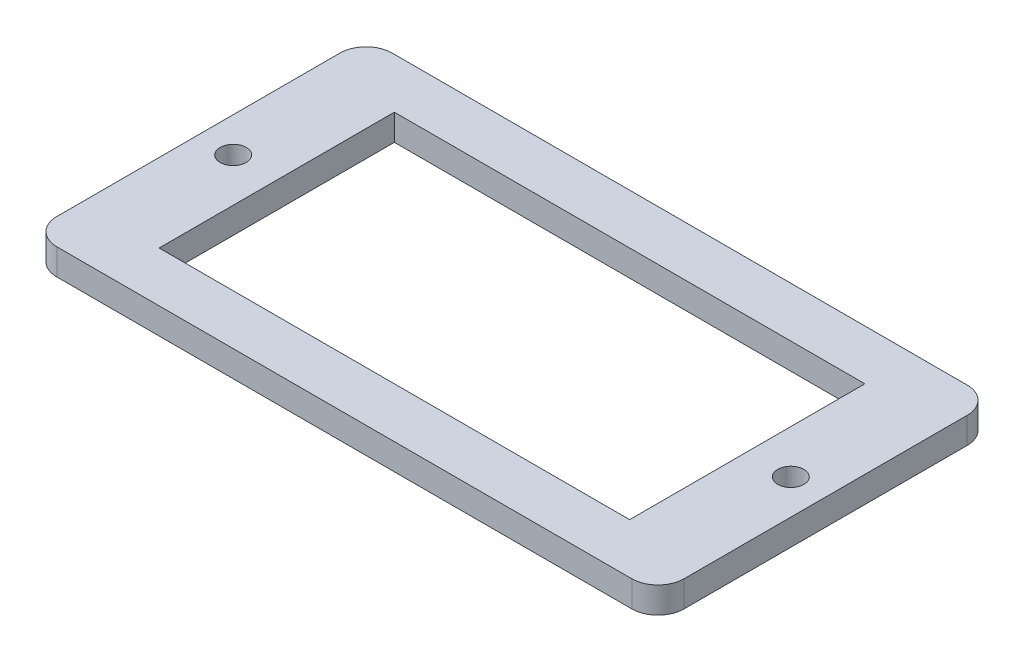
ISO-10303-21;
HEADER;
FILE_DESCRIPTION(('STEP AP214'),'2;1');
FILE_NAME('part.step','',(''),(''),'','','');
FILE_SCHEMA(('AUTOMOTIVE_DESIGN { 1 0 10303 214 1 1 1 1 }'));
ENDSEC;
DATA;
#1=APPLICATION_CONTEXT('core data for automotive mechanical design processes');
#2=APPLICATION_PROTOCOL_DEFINITION('international standard','automotive_design',2000,#1);
#3=PRODUCT_CONTEXT('',#1,'mechanical');
#4=PRODUCT('Part','Part','',(#3));
#5=PRODUCT_RELATED_PRODUCT_CATEGORY('part','',(#4));
#6=PRODUCT_DEFINITION_FORMATION('','',#4);
#7=PRODUCT_DEFINITION_CONTEXT('part definition',#1,'design');
#8=PRODUCT_DEFINITION('design','',#6,#7);
#9=PRODUCT_DEFINITION_SHAPE('','',#8);
#10=(LENGTH_UNIT() NAMED_UNIT(*) SI_UNIT(.MILLI.,.METRE.));
#11=(NAMED_UNIT(*) PLANE_ANGLE_UNIT() SI_UNIT($,.RADIAN.));
#12=(NAMED_UNIT(*) SI_UNIT($,.STERADIAN.) SOLID_ANGLE_UNIT());
#13=UNCERTAINTY_MEASURE_WITH_UNIT(LENGTH_MEASURE(1.E-05),#10,'distance_accuracy_value','');
#14=(GEOMETRIC_REPRESENTATION_CONTEXT(3) GLOBAL_UNCERTAINTY_ASSIGNED_CONTEXT((#13)) GLOBAL_UNIT_ASSIGNED_CONTEXT((#10,
#11,#12)) REPRESENTATION_CONTEXT('',''));
#15=CARTESIAN_POINT('',(0.,0.,0.));
#16=DIRECTION('',(0.,0.,1.));
#17=DIRECTION('',(1.,0.,0.));
#18=AXIS2_PLACEMENT_3D('',#15,#16,#17);
#19=CARTESIAN_POINT('',(0.,3.,0.));
#20=DIRECTION('',(0.,1.,0.));
#21=DIRECTION('',(0.,0.,1.));
#22=AXIS2_PLACEMENT_3D('',#19,#20,#21);
#23=PLANE('',#22);
#24=CARTESIAN_POINT('',(-32.,3.,0.));
#25=DIRECTION('',(0.,1.,0.));
#26=DIRECTION('',(0.,0.,1.));
#27=AXIS2_PLACEMENT_3D('',#24,#25,#26);
#28=CIRCLE('',#27,1.5);
#29=CARTESIAN_POINT('',(-32.,3.,1.5));
#30=VERTEX_POINT('',#29);
#31=EDGE_CURVE('E157',#30,#30,#28,.T.);
#32=ORIENTED_EDGE('',*,*,#31,.F.);
#33=EDGE_LOOP('',(#32));
#34=FACE_BOUND('',#33,.T.);
#35=DIRECTION('',(-1.,0.,0.));
#36=VECTOR('',#35,1.);
#37=CARTESIAN_POINT('',(-36.,3.,-19.25));
#38=LINE('',#37,#36);
#39=CARTESIAN_POINT('',(33.,3.,-19.25));
#40=VERTEX_POINT('',#39);
#41=CARTESIAN_POINT('',(-33.,3.,-19.25));
#42=VERTEX_POINT('',#41);
#43=EDGE_CURVE('E176',#40,#42,#38,.T.);
#44=ORIENTED_EDGE('',*,*,#43,.T.);
#45=CARTESIAN_POINT('',(-33.,3.,-16.25));
#46=DIRECTION('',(0.,1.,0.));
#47=DIRECTION('',(0.,0.,1.));
#48=AXIS2_PLACEMENT_3D('',#45,#46,#47);
#49=CIRCLE('',#48,3.);
#50=CARTESIAN_POINT('',(-36.,3.,-16.25));
#51=VERTEX_POINT('',#50);
#52=EDGE_CURVE('E211',#42,#51,#49,.T.);
#53=ORIENTED_EDGE('',*,*,#52,.T.);
#54=DIRECTION('',(0.,0.,1.));
#55=VECTOR('',#54,1.);
#56=CARTESIAN_POINT('',(-36.,3.,-19.25));
#57=LINE('',#56,#55);
#58=CARTESIAN_POINT('',(-36.,3.,16.25));
#59=VERTEX_POINT('',#58);
#60=EDGE_CURVE('E168',#51,#59,#57,.T.);
#61=ORIENTED_EDGE('',*,*,#60,.T.);
#62=CARTESIAN_POINT('',(-33.,3.,16.25));
#63=DIRECTION('',(0.,1.,0.));
#64=DIRECTION('',(0.,0.,1.));
#65=AXIS2_PLACEMENT_3D('',#62,#63,#64);
#66=CIRCLE('',#65,3.);
#67=CARTESIAN_POINT('',(-33.,3.,19.25));
#68=VERTEX_POINT('',#67);
#69=EDGE_CURVE('E206',#59,#68,#66,.T.);
#70=ORIENTED_EDGE('',*,*,#69,.T.);
#71=DIRECTION('',(1.,0.,0.));
#72=VECTOR('',#71,1.);
#73=CARTESIAN_POINT('',(-36.,3.,19.25));
#74=LINE('',#73,#72);
#75=CARTESIAN_POINT('',(33.,3.,19.25));
#76=VERTEX_POINT('',#75);
#77=EDGE_CURVE('E171',#68,#76,#74,.T.);
#78=ORIENTED_EDGE('',*,*,#77,.T.);
#79=CARTESIAN_POINT('',(33.,3.,16.25));
#80=DIRECTION('',(0.,1.,0.));
#81=DIRECTION('',(0.,0.,1.));
#82=AXIS2_PLACEMENT_3D('',#79,#80,#81);
#83=CIRCLE('',#82,3.);
#84=CARTESIAN_POINT('',(36.,3.,16.25));
#85=VERTEX_POINT('',#84);
#86=EDGE_CURVE('E55',#76,#85,#83,.T.);
#87=ORIENTED_EDGE('',*,*,#86,.T.);
#88=DIRECTION('',(0.,0.,-1.));
#89=VECTOR('',#88,1.);
#90=CARTESIAN_POINT('',(36.,3.,-19.25));
#91=LINE('',#90,#89);
#92=CARTESIAN_POINT('',(36.,3.,-16.25));
#93=VERTEX_POINT('',#92);
#94=EDGE_CURVE('E174',#85,#93,#91,.T.);
#95=ORIENTED_EDGE('',*,*,#94,.T.);
#96=CARTESIAN_POINT('',(33.,3.,-16.25));
#97=DIRECTION('',(0.,1.,0.));
#98=DIRECTION('',(0.,0.,1.));
#99=AXIS2_PLACEMENT_3D('',#96,#97,#98);
#100=CIRCLE('',#99,3.);
#101=EDGE_CURVE('E209',#93,#40,#100,.T.);
#102=ORIENTED_EDGE('',*,*,#101,.T.);
#103=EDGE_LOOP('',(#44,#53,#61,#70,#78,#87,#95,#102));
#104=FACE_BOUND('',#103,.T.);
#105=DIRECTION('',(1.,0.,0.));
#106=VECTOR('',#105,1.);
#107=CARTESIAN_POINT('',(-27.,3.,13.5));
#108=LINE('',#107,#106);
#109=CARTESIAN_POINT('',(-27.,3.,13.5));
#110=VERTEX_POINT('',#109);
#111=CARTESIAN_POINT('',(27.,3.,13.5));
#112=VERTEX_POINT('',#111);
#113=EDGE_CURVE('E134',#110,#112,#108,.T.);
#114=ORIENTED_EDGE('',*,*,#113,.F.);
#115=DIRECTION('',(0.,0.,1.));
#116=VECTOR('',#115,1.);
#117=CARTESIAN_POINT('',(-27.,3.,-13.5));
#118=LINE('',#117,#116);
#119=CARTESIAN_POINT('',(-27.,3.,-13.5));
#120=VERTEX_POINT('',#119);
#121=EDGE_CURVE('E124',#120,#110,#118,.T.);
#122=ORIENTED_EDGE('',*,*,#121,.F.);
#123=DIRECTION('',(-1.,0.,0.));
#124=VECTOR('',#123,1.);
#125=CARTESIAN_POINT('',(-27.,3.,-13.5));
#126=LINE('',#125,#124);
#127=CARTESIAN_POINT('',(27.,3.,-13.5));
#128=VERTEX_POINT('',#127);
#129=EDGE_CURVE('E150',#128,#120,#126,.T.);
#130=ORIENTED_EDGE('',*,*,#129,.F.);
#131=DIRECTION('',(0.,0.,-1.));
#132=VECTOR('',#131,1.);
#133=CARTESIAN_POINT('',(27.,3.,-13.5));
#134=LINE('',#133,#132);
#135=EDGE_CURVE('E148',#112,#128,#134,.T.);
#136=ORIENTED_EDGE('',*,*,#135,.F.);
#137=EDGE_LOOP('',(#114,#122,#130,#136));
#138=FACE_BOUND('',#137,.T.);
#139=CARTESIAN_POINT('',(32.,3.,0.));
#140=DIRECTION('',(0.,1.,0.));
#141=DIRECTION('',(0.,0.,1.));
#142=AXIS2_PLACEMENT_3D('',#139,#140,#141);
#143=CIRCLE('',#142,1.5);
#144=CARTESIAN_POINT('',(32.,3.,1.49999999999999));
#145=VERTEX_POINT('',#144);
#146=EDGE_CURVE('E395',#145,#145,#143,.T.);
#147=ORIENTED_EDGE('',*,*,#146,.F.);
#148=EDGE_LOOP('',(#147));
#149=FACE_BOUND('',#148,.T.);
#150=ADVANCED_FACE('F33',(#34,#104,#138,#149),#23,.T.);
#151=CARTESIAN_POINT('',(0.,0.,0.));
#152=DIRECTION('',(0.,1.,0.));
#153=DIRECTION('',(0.,0.,1.));
#154=AXIS2_PLACEMENT_3D('',#151,#152,#153);
#155=PLANE('',#154);
#156=CARTESIAN_POINT('',(-32.,0.,0.));
#157=DIRECTION('',(0.,1.,0.));
#158=DIRECTION('',(0.,0.,1.));
#159=AXIS2_PLACEMENT_3D('',#156,#157,#158);
#160=CIRCLE('',#159,1.5);
#161=CARTESIAN_POINT('',(-32.,0.,1.5));
#162=VERTEX_POINT('',#161);
#163=EDGE_CURVE('E398',#162,#162,#160,.T.);
#164=ORIENTED_EDGE('',*,*,#163,.T.);
#165=EDGE_LOOP('',(#164));
#166=FACE_BOUND('',#165,.T.);
#167=DIRECTION('',(0.,0.,1.));
#168=VECTOR('',#167,1.);
#169=CARTESIAN_POINT('',(-36.,0.,-19.25));
#170=LINE('',#169,#168);
#171=CARTESIAN_POINT('',(-36.,0.,-16.25));
#172=VERTEX_POINT('',#171);
#173=CARTESIAN_POINT('',(-36.,0.,16.25));
#174=VERTEX_POINT('',#173);
#175=EDGE_CURVE('E142',#172,#174,#170,.T.);
#176=ORIENTED_EDGE('',*,*,#175,.F.);
#177=CARTESIAN_POINT('',(-33.,0.,-16.25));
#178=DIRECTION('',(0.,1.,0.));
#179=DIRECTION('',(0.,0.,1.));
#180=AXIS2_PLACEMENT_3D('',#177,#178,#179);
#181=CIRCLE('',#180,3.);
#182=CARTESIAN_POINT('',(-33.,0.,-19.25));
#183=VERTEX_POINT('',#182);
#184=EDGE_CURVE('E199',#172,#183,#181,.F.);
#185=ORIENTED_EDGE('',*,*,#184,.T.);
#186=DIRECTION('',(-1.,0.,0.));
#187=VECTOR('',#186,1.);
#188=CARTESIAN_POINT('',(-36.,0.,-19.25));
#189=LINE('',#188,#187);
#190=CARTESIAN_POINT('',(33.,0.,-19.25));
#191=VERTEX_POINT('',#190);
#192=EDGE_CURVE('E172',#191,#183,#189,.T.);
#193=ORIENTED_EDGE('',*,*,#192,.F.);
#194=CARTESIAN_POINT('',(33.,0.,-16.25));
#195=DIRECTION('',(0.,1.,0.));
#196=DIRECTION('',(0.,0.,1.));
#197=AXIS2_PLACEMENT_3D('',#194,#195,#196);
#198=CIRCLE('',#197,3.);
#199=CARTESIAN_POINT('',(36.,0.,-16.25));
#200=VERTEX_POINT('',#199);
#201=EDGE_CURVE('E197',#191,#200,#198,.F.);
#202=ORIENTED_EDGE('',*,*,#201,.T.);
#203=DIRECTION('',(0.,0.,-1.));
#204=VECTOR('',#203,1.);
#205=CARTESIAN_POINT('',(36.,0.,-19.25));
#206=LINE('',#205,#204);
#207=CARTESIAN_POINT('',(36.,0.,16.25));
#208=VERTEX_POINT('',#207);
#209=EDGE_CURVE('E185',#208,#200,#206,.T.);
#210=ORIENTED_EDGE('',*,*,#209,.F.);
#211=CARTESIAN_POINT('',(33.,0.,16.25));
#212=DIRECTION('',(0.,1.,0.));
#213=DIRECTION('',(0.,0.,1.));
#214=AXIS2_PLACEMENT_3D('',#211,#212,#213);
#215=CIRCLE('',#214,3.);
#216=CARTESIAN_POINT('',(33.,0.,19.25));
#217=VERTEX_POINT('',#216);
#218=EDGE_CURVE('E195',#208,#217,#215,.F.);
#219=ORIENTED_EDGE('',*,*,#218,.T.);
#220=DIRECTION('',(1.,0.,0.));
#221=VECTOR('',#220,1.);
#222=CARTESIAN_POINT('',(-36.,0.,19.25));
#223=LINE('',#222,#221);
#224=CARTESIAN_POINT('',(-33.,0.,19.25));
#225=VERTEX_POINT('',#224);
#226=EDGE_CURVE('E182',#225,#217,#223,.T.);
#227=ORIENTED_EDGE('',*,*,#226,.F.);
#228=CARTESIAN_POINT('',(-33.,0.,16.25));
#229=DIRECTION('',(0.,1.,0.));
#230=DIRECTION('',(0.,0.,1.));
#231=AXIS2_PLACEMENT_3D('',#228,#229,#230);
#232=CIRCLE('',#231,3.);
#233=EDGE_CURVE('E193',#225,#174,#232,.F.);
#234=ORIENTED_EDGE('',*,*,#233,.T.);
#235=EDGE_LOOP('',(#176,#185,#193,#202,#210,#219,#227,#234));
#236=FACE_BOUND('',#235,.T.);
#237=DIRECTION('',(0.,0.,1.));
#238=VECTOR('',#237,1.);
#239=CARTESIAN_POINT('',(-27.,0.,-13.5));
#240=LINE('',#239,#238);
#241=CARTESIAN_POINT('',(-27.,0.,-13.5));
#242=VERTEX_POINT('',#241);
#243=CARTESIAN_POINT('',(-27.,0.,13.5));
#244=VERTEX_POINT('',#243);
#245=EDGE_CURVE('E155',#242,#244,#240,.T.);
#246=ORIENTED_EDGE('',*,*,#245,.T.);
#247=DIRECTION('',(1.,0.,0.));
#248=VECTOR('',#247,1.);
#249=CARTESIAN_POINT('',(-27.,0.,13.5));
#250=LINE('',#249,#248);
#251=CARTESIAN_POINT('',(27.,0.,13.5));
#252=VERTEX_POINT('',#251);
#253=EDGE_CURVE('E141',#244,#252,#250,.T.);
#254=ORIENTED_EDGE('',*,*,#253,.T.);
#255=DIRECTION('',(0.,0.,-1.));
#256=VECTOR('',#255,1.);
#257=CARTESIAN_POINT('',(27.,0.,-13.5));
#258=LINE('',#257,#256);
#259=CARTESIAN_POINT('',(27.,0.,-13.5));
#260=VERTEX_POINT('',#259);
#261=EDGE_CURVE('E159',#252,#260,#258,.T.);
#262=ORIENTED_EDGE('',*,*,#261,.T.);
#263=DIRECTION('',(-1.,0.,0.));
#264=VECTOR('',#263,1.);
#265=CARTESIAN_POINT('',(-27.,0.,-13.5));
#266=LINE('',#265,#264);
#267=EDGE_CURVE('E135',#260,#242,#266,.T.);
#268=ORIENTED_EDGE('',*,*,#267,.T.);
#269=EDGE_LOOP('',(#246,#254,#262,#268));
#270=FACE_BOUND('',#269,.T.);
#271=CARTESIAN_POINT('',(32.,0.,0.));
#272=DIRECTION('',(0.,1.,0.));
#273=DIRECTION('',(0.,0.,1.));
#274=AXIS2_PLACEMENT_3D('',#271,#272,#273);
#275=CIRCLE('',#274,1.5);
#276=CARTESIAN_POINT('',(32.,0.,1.49999999999999));
#277=VERTEX_POINT('',#276);
#278=EDGE_CURVE('E393',#277,#277,#275,.T.);
#279=ORIENTED_EDGE('',*,*,#278,.T.);
#280=EDGE_LOOP('',(#279));
#281=FACE_BOUND('',#280,.T.);
#282=ADVANCED_FACE('F227',(#166,#236,#270,#281),#155,.F.);
#283=CARTESIAN_POINT('',(-36.,3.,-19.25));
#284=DIRECTION('',(1.,0.,0.));
#285=DIRECTION('',(0.,0.,-1.));
#286=AXIS2_PLACEMENT_3D('',#283,#284,#285);
#287=PLANE('',#286);
#288=ORIENTED_EDGE('',*,*,#60,.F.);
#289=DIRECTION('',(0.,-1.,0.));
#290=VECTOR('',#289,1.);
#291=CARTESIAN_POINT('',(-36.,3.,-16.25));
#292=LINE('',#291,#290);
#293=EDGE_CURVE('E190',#51,#172,#292,.T.);
#294=ORIENTED_EDGE('',*,*,#293,.T.);
#295=ORIENTED_EDGE('',*,*,#175,.T.);
#296=DIRECTION('',(0.,-1.,0.));
#297=VECTOR('',#296,1.);
#298=CARTESIAN_POINT('',(-36.,3.,16.25));
#299=LINE('',#298,#297);
#300=EDGE_CURVE('E179',#174,#59,#299,.F.);
#301=ORIENTED_EDGE('',*,*,#300,.T.);
#302=EDGE_LOOP('',(#288,#294,#295,#301));
#303=FACE_BOUND('',#302,.T.);
#304=ADVANCED_FACE('F249',(#303),#287,.F.);
#305=CARTESIAN_POINT('',(-36.,3.,19.25));
#306=DIRECTION('',(0.,0.,-1.));
#307=DIRECTION('',(-1.,0.,0.));
#308=AXIS2_PLACEMENT_3D('',#305,#306,#307);
#309=PLANE('',#308);
#310=ORIENTED_EDGE('',*,*,#226,.T.);
#311=DIRECTION('',(0.,-1.,0.));
#312=VECTOR('',#311,1.);
#313=CARTESIAN_POINT('',(33.,3.,19.25));
#314=LINE('',#313,#312);
#315=EDGE_CURVE('E11',#217,#76,#314,.F.);
#316=ORIENTED_EDGE('',*,*,#315,.T.);
#317=ORIENTED_EDGE('',*,*,#77,.F.);
#318=DIRECTION('',(0.,-1.,0.));
#319=VECTOR('',#318,1.);
#320=CARTESIAN_POINT('',(-33.,3.,19.25));
#321=LINE('',#320,#319);
#322=EDGE_CURVE('E41',#68,#225,#321,.T.);
#323=ORIENTED_EDGE('',*,*,#322,.T.);
#324=EDGE_LOOP('',(#310,#316,#317,#323));
#325=FACE_BOUND('',#324,.T.);
#326=ADVANCED_FACE('F221',(#325),#309,.F.);
#327=CARTESIAN_POINT('',(36.,3.,-19.25));
#328=DIRECTION('',(-1.,0.,0.));
#329=DIRECTION('',(0.,0.,1.));
#330=AXIS2_PLACEMENT_3D('',#327,#328,#329);
#331=PLANE('',#330);
#332=ORIENTED_EDGE('',*,*,#209,.T.);
#333=DIRECTION('',(0.,-1.,0.));
#334=VECTOR('',#333,1.);
#335=CARTESIAN_POINT('',(36.,3.,-16.25));
#336=LINE('',#335,#334);
#337=EDGE_CURVE('E48',#200,#93,#336,.F.);
#338=ORIENTED_EDGE('',*,*,#337,.T.);
#339=ORIENTED_EDGE('',*,*,#94,.F.);
#340=DIRECTION('',(0.,-1.,0.));
#341=VECTOR('',#340,1.);
#342=CARTESIAN_POINT('',(36.,3.,16.25));
#343=LINE('',#342,#341);
#344=EDGE_CURVE('E213',#85,#208,#343,.T.);
#345=ORIENTED_EDGE('',*,*,#344,.T.);
#346=EDGE_LOOP('',(#332,#338,#339,#345));
#347=FACE_BOUND('',#346,.T.);
#348=ADVANCED_FACE('F233',(#347),#331,.F.);
#349=CARTESIAN_POINT('',(-36.,3.,-19.25));
#350=DIRECTION('',(0.,0.,1.));
#351=DIRECTION('',(1.,0.,0.));
#352=AXIS2_PLACEMENT_3D('',#349,#350,#351);
#353=PLANE('',#352);
#354=ORIENTED_EDGE('',*,*,#192,.T.);
#355=DIRECTION('',(0.,-1.,0.));
#356=VECTOR('',#355,1.);
#357=CARTESIAN_POINT('',(-33.,3.,-19.25));
#358=LINE('',#357,#356);
#359=EDGE_CURVE('E204',#183,#42,#358,.F.);
#360=ORIENTED_EDGE('',*,*,#359,.T.);
#361=ORIENTED_EDGE('',*,*,#43,.F.);
#362=DIRECTION('',(0.,-1.,0.));
#363=VECTOR('',#362,1.);
#364=CARTESIAN_POINT('',(33.,3.,-19.25));
#365=LINE('',#364,#363);
#366=EDGE_CURVE('E201',#40,#191,#365,.T.);
#367=ORIENTED_EDGE('',*,*,#366,.T.);
#368=EDGE_LOOP('',(#354,#360,#361,#367));
#369=FACE_BOUND('',#368,.T.);
#370=ADVANCED_FACE('F241',(#369),#353,.F.);
#371=CARTESIAN_POINT('',(-27.,3.,-13.5));
#372=DIRECTION('',(1.,0.,0.));
#373=DIRECTION('',(0.,0.,-1.));
#374=AXIS2_PLACEMENT_3D('',#371,#372,#373);
#375=PLANE('',#374);
#376=ORIENTED_EDGE('',*,*,#245,.F.);
#377=DIRECTION('',(0.,-1.,0.));
#378=VECTOR('',#377,1.);
#379=CARTESIAN_POINT('',(-27.,3.,-13.5));
#380=LINE('',#379,#378);
#381=EDGE_CURVE('E130',#120,#242,#380,.T.);
#382=ORIENTED_EDGE('',*,*,#381,.F.);
#383=ORIENTED_EDGE('',*,*,#121,.T.);
#384=DIRECTION('',(0.,-1.,0.));
#385=VECTOR('',#384,1.);
#386=CARTESIAN_POINT('',(-27.,3.,13.5));
#387=LINE('',#386,#385);
#388=EDGE_CURVE('E127',#110,#244,#387,.T.);
#389=ORIENTED_EDGE('',*,*,#388,.T.);
#390=EDGE_LOOP('',(#376,#382,#383,#389));
#391=FACE_BOUND('',#390,.T.);
#392=ADVANCED_FACE('F126',(#391),#375,.T.);
#393=CARTESIAN_POINT('',(-27.,3.,13.5));
#394=DIRECTION('',(0.,0.,-1.));
#395=DIRECTION('',(-1.,0.,0.));
#396=AXIS2_PLACEMENT_3D('',#393,#394,#395);
#397=PLANE('',#396);
#398=ORIENTED_EDGE('',*,*,#253,.F.);
#399=ORIENTED_EDGE('',*,*,#388,.F.);
#400=ORIENTED_EDGE('',*,*,#113,.T.);
#401=DIRECTION('',(0.,-1.,0.));
#402=VECTOR('',#401,1.);
#403=CARTESIAN_POINT('',(27.,3.,13.5));
#404=LINE('',#403,#402);
#405=EDGE_CURVE('E143',#112,#252,#404,.T.);
#406=ORIENTED_EDGE('',*,*,#405,.T.);
#407=EDGE_LOOP('',(#398,#399,#400,#406));
#408=FACE_BOUND('',#407,.T.);
#409=ADVANCED_FACE('F138',(#408),#397,.T.);
#410=CARTESIAN_POINT('',(27.,3.,-13.5));
#411=DIRECTION('',(-1.,0.,0.));
#412=DIRECTION('',(0.,0.,1.));
#413=AXIS2_PLACEMENT_3D('',#410,#411,#412);
#414=PLANE('',#413);
#415=ORIENTED_EDGE('',*,*,#261,.F.);
#416=ORIENTED_EDGE('',*,*,#405,.F.);
#417=ORIENTED_EDGE('',*,*,#135,.T.);
#418=DIRECTION('',(0.,-1.,0.));
#419=VECTOR('',#418,1.);
#420=CARTESIAN_POINT('',(27.,3.,-13.5));
#421=LINE('',#420,#419);
#422=EDGE_CURVE('E165',#128,#260,#421,.T.);
#423=ORIENTED_EDGE('',*,*,#422,.T.);
#424=EDGE_LOOP('',(#415,#416,#417,#423));
#425=FACE_BOUND('',#424,.T.);
#426=ADVANCED_FACE('F326',(#425),#414,.T.);
#427=CARTESIAN_POINT('',(-27.,3.,-13.5));
#428=DIRECTION('',(0.,0.,1.));
#429=DIRECTION('',(1.,0.,0.));
#430=AXIS2_PLACEMENT_3D('',#427,#428,#429);
#431=PLANE('',#430);
#432=ORIENTED_EDGE('',*,*,#267,.F.);
#433=ORIENTED_EDGE('',*,*,#422,.F.);
#434=ORIENTED_EDGE('',*,*,#129,.T.);
#435=ORIENTED_EDGE('',*,*,#381,.T.);
#436=EDGE_LOOP('',(#432,#433,#434,#435));
#437=FACE_BOUND('',#436,.T.);
#438=ADVANCED_FACE('F317',(#437),#431,.T.);
#439=CARTESIAN_POINT('',(-32.,3.,0.));
#440=DIRECTION('',(0.,-1.,0.));
#441=DIRECTION('',(0.,0.,-1.));
#442=AXIS2_PLACEMENT_3D('',#439,#440,#441);
#443=CYLINDRICAL_SURFACE('',#442,1.5);
#444=ORIENTED_EDGE('',*,*,#31,.T.);
#445=EDGE_LOOP('',(#444));
#446=FACE_BOUND('',#445,.T.);
#447=ORIENTED_EDGE('',*,*,#163,.F.);
#448=EDGE_LOOP('',(#447));
#449=FACE_BOUND('',#448,.T.);
#450=ADVANCED_FACE('F308',(#446,#449),#443,.F.);
#451=CARTESIAN_POINT('',(32.,3.,0.));
#452=DIRECTION('',(0.,-1.,0.));
#453=DIRECTION('',(0.,0.,-1.));
#454=AXIS2_PLACEMENT_3D('',#451,#452,#453);
#455=CYLINDRICAL_SURFACE('',#454,1.5);
#456=ORIENTED_EDGE('',*,*,#146,.T.);
#457=EDGE_LOOP('',(#456));
#458=FACE_BOUND('',#457,.T.);
#459=ORIENTED_EDGE('',*,*,#278,.F.);
#460=EDGE_LOOP('',(#459));
#461=FACE_BOUND('',#460,.T.);
#462=ADVANCED_FACE('F277',(#458,#461),#455,.F.);
#463=CARTESIAN_POINT('',(-33.,3.,-16.25));
#464=DIRECTION('',(0.,-1.,0.));
#465=DIRECTION('',(0.,0.,-1.));
#466=AXIS2_PLACEMENT_3D('',#463,#464,#465);
#467=CYLINDRICAL_SURFACE('',#466,3.);
#468=ORIENTED_EDGE('',*,*,#52,.F.);
#469=ORIENTED_EDGE('',*,*,#359,.F.);
#470=ORIENTED_EDGE('',*,*,#184,.F.);
#471=ORIENTED_EDGE('',*,*,#293,.F.);
#472=EDGE_LOOP('',(#468,#469,#470,#471));
#473=FACE_BOUND('',#472,.T.);
#474=ADVANCED_FACE('F246',(#473),#467,.T.);
#475=CARTESIAN_POINT('',(33.,3.,-16.25));
#476=DIRECTION('',(0.,-1.,0.));
#477=DIRECTION('',(0.,0.,-1.));
#478=AXIS2_PLACEMENT_3D('',#475,#476,#477);
#479=CYLINDRICAL_SURFACE('',#478,3.);
#480=ORIENTED_EDGE('',*,*,#101,.F.);
#481=ORIENTED_EDGE('',*,*,#337,.F.);
#482=ORIENTED_EDGE('',*,*,#201,.F.);
#483=ORIENTED_EDGE('',*,*,#366,.F.);
#484=EDGE_LOOP('',(#480,#481,#482,#483));
#485=FACE_BOUND('',#484,.T.);
#486=ADVANCED_FACE('F238',(#485),#479,.T.);
#487=CARTESIAN_POINT('',(33.,3.,16.25));
#488=DIRECTION('',(0.,-1.,0.));
#489=DIRECTION('',(0.,0.,-1.));
#490=AXIS2_PLACEMENT_3D('',#487,#488,#489);
#491=CYLINDRICAL_SURFACE('',#490,3.);
#492=ORIENTED_EDGE('',*,*,#86,.F.);
#493=ORIENTED_EDGE('',*,*,#315,.F.);
#494=ORIENTED_EDGE('',*,*,#218,.F.);
#495=ORIENTED_EDGE('',*,*,#344,.F.);
#496=EDGE_LOOP('',(#492,#493,#494,#495));
#497=FACE_BOUND('',#496,.T.);
#498=ADVANCED_FACE('F232',(#497),#491,.T.);
#499=CARTESIAN_POINT('',(-33.,3.,16.25));
#500=DIRECTION('',(0.,-1.,0.));
#501=DIRECTION('',(0.,0.,-1.));
#502=AXIS2_PLACEMENT_3D('',#499,#500,#501);
#503=CYLINDRICAL_SURFACE('',#502,3.);
#504=ORIENTED_EDGE('',*,*,#69,.F.);
#505=ORIENTED_EDGE('',*,*,#300,.F.);
#506=ORIENTED_EDGE('',*,*,#233,.F.);
#507=ORIENTED_EDGE('',*,*,#322,.F.);
#508=EDGE_LOOP('',(#504,#505,#506,#507));
#509=FACE_BOUND('',#508,.T.);
#510=ADVANCED_FACE('F35',(#509),#503,.T.);
#511=CLOSED_SHELL('',(#150,#282,#304,#326,#348,#370,#392,#409,#426,#438,#450,#462,#474,#486,
#498,#510));
#512=MANIFOLD_SOLID_BREP('B2',#511);
#513=ADVANCED_BREP_SHAPE_REPRESENTATION('',(#18,#512),#14);
#514=SHAPE_DEFINITION_REPRESENTATION(#9,#513);
ENDSEC;
END-ISO-10303-21;
